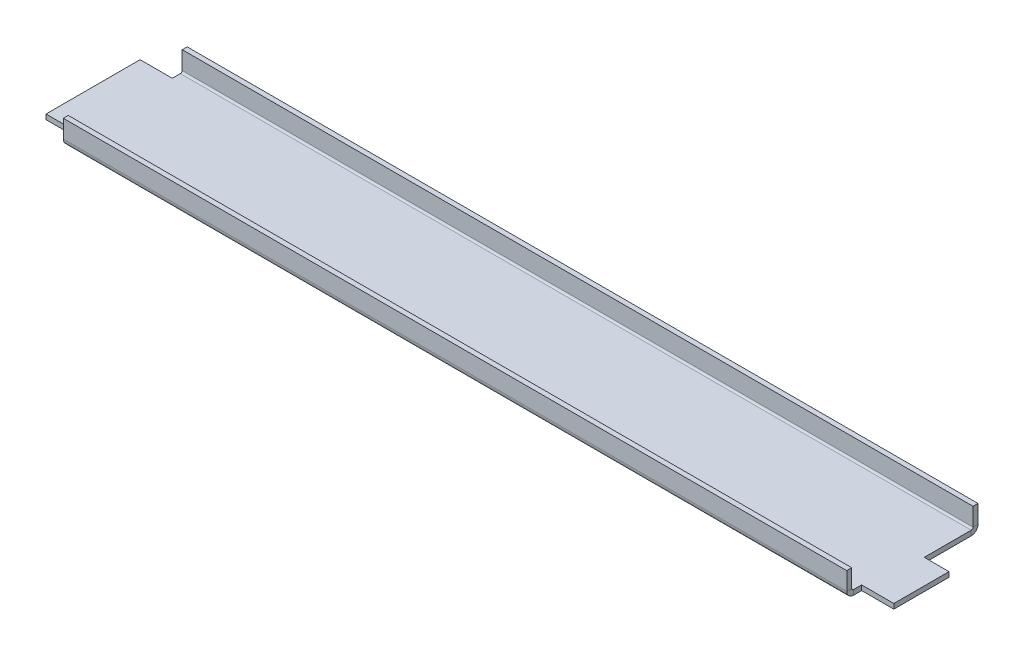
ISO-10303-21;
HEADER;
FILE_DESCRIPTION(('STEP AP214'),'2;1');
FILE_NAME('part.step','',(''),(''),'','','');
FILE_SCHEMA(('AUTOMOTIVE_DESIGN { 1 0 10303 214 1 1 1 1 }'));
ENDSEC;
DATA;
#1=APPLICATION_CONTEXT('core data for automotive mechanical design processes');
#2=APPLICATION_PROTOCOL_DEFINITION('international standard','automotive_design',2000,#1);
#3=PRODUCT_CONTEXT('',#1,'mechanical');
#4=PRODUCT('Part','Part','',(#3));
#5=PRODUCT_RELATED_PRODUCT_CATEGORY('part','',(#4));
#6=PRODUCT_DEFINITION_FORMATION('','',#4);
#7=PRODUCT_DEFINITION_CONTEXT('part definition',#1,'design');
#8=PRODUCT_DEFINITION('design','',#6,#7);
#9=PRODUCT_DEFINITION_SHAPE('','',#8);
#10=(LENGTH_UNIT() NAMED_UNIT(*) SI_UNIT(.MILLI.,.METRE.));
#11=(NAMED_UNIT(*) PLANE_ANGLE_UNIT() SI_UNIT($,.RADIAN.));
#12=(NAMED_UNIT(*) SI_UNIT($,.STERADIAN.) SOLID_ANGLE_UNIT());
#13=UNCERTAINTY_MEASURE_WITH_UNIT(LENGTH_MEASURE(1.E-05),#10,'distance_accuracy_value','');
#14=(GEOMETRIC_REPRESENTATION_CONTEXT(3) GLOBAL_UNCERTAINTY_ASSIGNED_CONTEXT((#13)) GLOBAL_UNIT_ASSIGNED_CONTEXT((#10,
#11,#12)) REPRESENTATION_CONTEXT('',''));
#15=CARTESIAN_POINT('',(0.,0.,0.));
#16=DIRECTION('',(0.,0.,1.));
#17=DIRECTION('',(1.,0.,0.));
#18=AXIS2_PLACEMENT_3D('',#15,#16,#17);
#19=CARTESIAN_POINT('',(158.2,0.,41.5713514705962));
#20=DIRECTION('',(1.,0.,0.));
#21=DIRECTION('',(0.,0.,-1.));
#22=AXIS2_PLACEMENT_3D('',#19,#20,#21);
#23=PLANE('',#22);
#24=DIRECTION('',(0.,-1.,0.));
#25=VECTOR('',#24,1.);
#26=CARTESIAN_POINT('',(158.2,0.,25.));
#27=LINE('',#26,#25);
#28=CARTESIAN_POINT('',(158.2,10.0000000008488,25.));
#29=VERTEX_POINT('',#28);
#30=CARTESIAN_POINT('',(158.2,2.7366,25.));
#31=VERTEX_POINT('',#30);
#32=EDGE_CURVE('E237',#29,#31,#27,.T.);
#33=ORIENTED_EDGE('',*,*,#32,.T.);
#34=DIRECTION('',(0.,0.,-1.));
#35=VECTOR('',#34,1.);
#36=CARTESIAN_POINT('',(158.2,2.7366,25.));
#37=LINE('',#36,#35);
#38=CARTESIAN_POINT('',(158.2,2.7366,23.));
#39=VERTEX_POINT('',#38);
#40=EDGE_CURVE('E14',#31,#39,#37,.T.);
#41=ORIENTED_EDGE('',*,*,#40,.T.);
#42=DIRECTION('',(0.,-1.,0.));
#43=VECTOR('',#42,1.);
#44=CARTESIAN_POINT('',(158.2,0.,23.));
#45=LINE('',#44,#43);
#46=CARTESIAN_POINT('',(158.2,10.,23.));
#47=VERTEX_POINT('',#46);
#48=EDGE_CURVE('E106',#47,#39,#45,.T.);
#49=ORIENTED_EDGE('',*,*,#48,.F.);
#50=DIRECTION('',(0.,0.,1.));
#51=VECTOR('',#50,1.);
#52=CARTESIAN_POINT('',(158.2,10.,25.));
#53=LINE('',#52,#51);
#54=EDGE_CURVE('E132',#47,#29,#53,.T.);
#55=ORIENTED_EDGE('',*,*,#54,.T.);
#56=EDGE_LOOP('',(#33,#41,#49,#55));
#57=FACE_BOUND('',#56,.T.);
#58=ADVANCED_FACE('F87',(#57),#23,.T.);
#59=DIRECTION('',(0.,0.,-1.));
#60=VECTOR('',#59,1.);
#61=CARTESIAN_POINT('',(158.2,2.,0.));
#62=LINE('',#61,#60);
#63=CARTESIAN_POINT('',(158.2,2.,22.2634));
#64=VERTEX_POINT('',#63);
#65=CARTESIAN_POINT('',(158.2,2.,19.));
#66=VERTEX_POINT('',#65);
#67=EDGE_CURVE('E332',#64,#66,#62,.T.);
#68=ORIENTED_EDGE('',*,*,#67,.F.);
#69=DIRECTION('',(0.,-1.,0.));
#70=VECTOR('',#69,1.);
#71=CARTESIAN_POINT('',(158.2,2.,22.2634));
#72=LINE('',#71,#70);
#73=CARTESIAN_POINT('',(158.2,0.,22.2634));
#74=VERTEX_POINT('',#73);
#75=EDGE_CURVE('E98',#64,#74,#72,.T.);
#76=ORIENTED_EDGE('',*,*,#75,.T.);
#77=DIRECTION('',(0.,0.,-1.));
#78=VECTOR('',#77,1.);
#79=CARTESIAN_POINT('',(158.2,0.,41.5713514705962));
#80=LINE('',#79,#78);
#81=CARTESIAN_POINT('',(158.2,0.,19.));
#82=VERTEX_POINT('',#81);
#83=EDGE_CURVE('E498',#74,#82,#80,.T.);
#84=ORIENTED_EDGE('',*,*,#83,.T.);
#85=DIRECTION('',(0.,1.,0.));
#86=VECTOR('',#85,1.);
#87=CARTESIAN_POINT('',(158.2,0.,19.));
#88=LINE('',#87,#86);
#89=EDGE_CURVE('E309',#82,#66,#88,.T.);
#90=ORIENTED_EDGE('',*,*,#89,.T.);
#91=EDGE_LOOP('',(#68,#76,#84,#90));
#92=FACE_BOUND('',#91,.T.);
#93=ADVANCED_FACE('F509',(#92),#23,.T.);
#94=CARTESIAN_POINT('',(161.2,0.,-41.5713514705962));
#95=DIRECTION('',(1.,0.,0.));
#96=DIRECTION('',(0.,0.,-1.));
#97=AXIS2_PLACEMENT_3D('',#94,#95,#96);
#98=PLANE('',#97);
#99=DIRECTION('',(0.,1.,0.));
#100=VECTOR('',#99,1.);
#101=CARTESIAN_POINT('',(161.2,0.,-23.));
#102=LINE('',#101,#100);
#103=CARTESIAN_POINT('',(161.2,2.7366,-23.));
#104=VERTEX_POINT('',#103);
#105=CARTESIAN_POINT('',(161.2,10.,-23.));
#106=VERTEX_POINT('',#105);
#107=EDGE_CURVE('E305',#104,#106,#102,.T.);
#108=ORIENTED_EDGE('',*,*,#107,.F.);
#109=DIRECTION('',(0.,0.,-1.));
#110=VECTOR('',#109,1.);
#111=CARTESIAN_POINT('',(161.2,2.73659999999999,-41.5713514705962));
#112=LINE('',#111,#110);
#113=CARTESIAN_POINT('',(161.2,2.7366,-25.));
#114=VERTEX_POINT('',#113);
#115=EDGE_CURVE('E127',#104,#114,#112,.T.);
#116=ORIENTED_EDGE('',*,*,#115,.T.);
#117=DIRECTION('',(0.,1.,0.));
#118=VECTOR('',#117,1.);
#119=CARTESIAN_POINT('',(161.2,0.,-25.));
#120=LINE('',#119,#118);
#121=CARTESIAN_POINT('',(161.2,10.,-25.));
#122=VERTEX_POINT('',#121);
#123=EDGE_CURVE('E304',#114,#122,#120,.T.);
#124=ORIENTED_EDGE('',*,*,#123,.T.);
#125=DIRECTION('',(0.,0.,1.));
#126=VECTOR('',#125,1.);
#127=CARTESIAN_POINT('',(161.2,10.,-25.));
#128=LINE('',#127,#126);
#129=EDGE_CURVE('E289',#122,#106,#128,.T.);
#130=ORIENTED_EDGE('',*,*,#129,.T.);
#131=EDGE_LOOP('',(#108,#116,#124,#130));
#132=FACE_BOUND('',#131,.T.);
#133=ADVANCED_FACE('F89',(#132),#98,.T.);
#134=CARTESIAN_POINT('',(161.2,0.,0.));
#135=DIRECTION('',(-1.,0.,0.));
#136=DIRECTION('',(0.,0.,1.));
#137=AXIS2_PLACEMENT_3D('',#134,#135,#136);
#138=PLANE('',#137);
#139=DIRECTION('',(0.,0.,1.));
#140=VECTOR('',#139,1.);
#141=CARTESIAN_POINT('',(161.2,0.,0.));
#142=LINE('',#141,#140);
#143=CARTESIAN_POINT('',(161.2,0.,-22.2634));
#144=VERTEX_POINT('',#143);
#145=CARTESIAN_POINT('',(161.2,0.,-3.30000000000009));
#146=VERTEX_POINT('',#145);
#147=EDGE_CURVE('E419',#144,#146,#142,.T.);
#148=ORIENTED_EDGE('',*,*,#147,.F.);
#149=DIRECTION('',(0.,1.,0.));
#150=VECTOR('',#149,1.);
#151=CARTESIAN_POINT('',(161.2,0.,-22.2634));
#152=LINE('',#151,#150);
#153=CARTESIAN_POINT('',(161.2,2.,-22.2634));
#154=VERTEX_POINT('',#153);
#155=EDGE_CURVE('E293',#144,#154,#152,.T.);
#156=ORIENTED_EDGE('',*,*,#155,.T.);
#157=DIRECTION('',(0.,0.,1.));
#158=VECTOR('',#157,1.);
#159=CARTESIAN_POINT('',(161.2,2.,0.));
#160=LINE('',#159,#158);
#161=CARTESIAN_POINT('',(161.2,2.,-3.30000000000009));
#162=VERTEX_POINT('',#161);
#163=EDGE_CURVE('E414',#154,#162,#160,.T.);
#164=ORIENTED_EDGE('',*,*,#163,.T.);
#165=DIRECTION('',(0.,-1.,0.));
#166=VECTOR('',#165,1.);
#167=CARTESIAN_POINT('',(161.2,10.0000000008488,-3.30000000000009));
#168=LINE('',#167,#166);
#169=EDGE_CURVE('E410',#162,#146,#168,.T.);
#170=ORIENTED_EDGE('',*,*,#169,.T.);
#171=EDGE_LOOP('',(#148,#156,#164,#170));
#172=FACE_BOUND('',#171,.T.);
#173=ADVANCED_FACE('F483',(#172),#138,.F.);
#174=CARTESIAN_POINT('',(171.2,2.,-25.));
#175=DIRECTION('',(-1.,0.,0.));
#176=DIRECTION('',(0.,0.,1.));
#177=AXIS2_PLACEMENT_3D('',#174,#175,#176);
#178=PLANE('',#177);
#179=DIRECTION('',(0.,1.,0.));
#180=VECTOR('',#179,1.);
#181=CARTESIAN_POINT('',(171.2,2.,19.));
#182=LINE('',#181,#180);
#183=CARTESIAN_POINT('',(171.2,0.,19.));
#184=VERTEX_POINT('',#183);
#185=CARTESIAN_POINT('',(171.2,2.,19.));
#186=VERTEX_POINT('',#185);
#187=EDGE_CURVE('E349',#184,#186,#182,.T.);
#188=ORIENTED_EDGE('',*,*,#187,.F.);
#189=DIRECTION('',(0.,0.,-1.));
#190=VECTOR('',#189,1.);
#191=CARTESIAN_POINT('',(171.2,0.,-25.));
#192=LINE('',#191,#190);
#193=CARTESIAN_POINT('',(171.2,0.,-3.30000000000009));
#194=VERTEX_POINT('',#193);
#195=EDGE_CURVE('E457',#184,#194,#192,.T.);
#196=ORIENTED_EDGE('',*,*,#195,.T.);
#197=DIRECTION('',(0.,-1.,0.));
#198=VECTOR('',#197,1.);
#199=CARTESIAN_POINT('',(171.2,10.0000000008488,-3.30000000000009));
#200=LINE('',#199,#198);
#201=CARTESIAN_POINT('',(171.2,2.,-3.30000000000009));
#202=VERTEX_POINT('',#201);
#203=EDGE_CURVE('E411',#202,#194,#200,.T.);
#204=ORIENTED_EDGE('',*,*,#203,.F.);
#205=DIRECTION('',(0.,0.,-1.));
#206=VECTOR('',#205,1.);
#207=CARTESIAN_POINT('',(171.2,2.,-25.));
#208=LINE('',#207,#206);
#209=EDGE_CURVE('E460',#186,#202,#208,.T.);
#210=ORIENTED_EDGE('',*,*,#209,.F.);
#211=EDGE_LOOP('',(#188,#196,#204,#210));
#212=FACE_BOUND('',#211,.T.);
#213=ADVANCED_FACE('F492',(#212),#178,.F.);
#214=CARTESIAN_POINT('',(0.,2.,0.));
#215=DIRECTION('',(0.,1.,0.));
#216=DIRECTION('',(0.,0.,1.));
#217=AXIS2_PLACEMENT_3D('',#214,#215,#216);
#218=PLANE('',#217);
#219=ORIENTED_EDGE('',*,*,#163,.F.);
#220=DIRECTION('',(-1.,0.,0.));
#221=VECTOR('',#220,1.);
#222=CARTESIAN_POINT('',(-171.2,1.99999999999999,-22.2634));
#223=LINE('',#222,#221);
#224=CARTESIAN_POINT('',(-158.2,1.99999999999999,-22.2634));
#225=VERTEX_POINT('',#224);
#226=EDGE_CURVE('E431',#225,#154,#223,.F.);
#227=ORIENTED_EDGE('',*,*,#226,.F.);
#228=DIRECTION('',(0.,0.,-1.));
#229=VECTOR('',#228,1.);
#230=CARTESIAN_POINT('',(-158.2,2.,0.));
#231=LINE('',#230,#229);
#232=CARTESIAN_POINT('',(-158.2,2.,-19.));
#233=VERTEX_POINT('',#232);
#234=EDGE_CURVE('E381',#233,#225,#231,.T.);
#235=ORIENTED_EDGE('',*,*,#234,.F.);
#236=DIRECTION('',(1.,0.,0.));
#237=VECTOR('',#236,1.);
#238=CARTESIAN_POINT('',(0.,2.,-19.));
#239=LINE('',#238,#237);
#240=CARTESIAN_POINT('',(-171.2,2.,-19.));
#241=VERTEX_POINT('',#240);
#242=EDGE_CURVE('E407',#241,#233,#239,.T.);
#243=ORIENTED_EDGE('',*,*,#242,.F.);
#244=DIRECTION('',(0.,0.,1.));
#245=VECTOR('',#244,1.);
#246=CARTESIAN_POINT('',(-171.2,2.,-25.));
#247=LINE('',#246,#245);
#248=CARTESIAN_POINT('',(-171.2,2.,19.));
#249=VERTEX_POINT('',#248);
#250=EDGE_CURVE('E463',#241,#249,#247,.T.);
#251=ORIENTED_EDGE('',*,*,#250,.T.);
#252=DIRECTION('',(-1.,0.,0.));
#253=VECTOR('',#252,1.);
#254=CARTESIAN_POINT('',(0.,2.,19.));
#255=LINE('',#254,#253);
#256=CARTESIAN_POINT('',(-158.2,2.,19.));
#257=VERTEX_POINT('',#256);
#258=EDGE_CURVE('E404',#257,#249,#255,.T.);
#259=ORIENTED_EDGE('',*,*,#258,.F.);
#260=DIRECTION('',(0.,0.,-1.));
#261=VECTOR('',#260,1.);
#262=CARTESIAN_POINT('',(-158.2,2.,0.));
#263=LINE('',#262,#261);
#264=CARTESIAN_POINT('',(-158.2,2.,22.2634));
#265=VERTEX_POINT('',#264);
#266=EDGE_CURVE('E255',#265,#257,#263,.T.);
#267=ORIENTED_EDGE('',*,*,#266,.F.);
#268=DIRECTION('',(1.,0.,0.));
#269=VECTOR('',#268,1.);
#270=CARTESIAN_POINT('',(171.2,2.,22.2634));
#271=LINE('',#270,#269);
#272=EDGE_CURVE('E241',#64,#265,#271,.F.);
#273=ORIENTED_EDGE('',*,*,#272,.F.);
#274=ORIENTED_EDGE('',*,*,#67,.T.);
#275=DIRECTION('',(1.,0.,0.));
#276=VECTOR('',#275,1.);
#277=CARTESIAN_POINT('',(0.,2.,19.));
#278=LINE('',#277,#276);
#279=EDGE_CURVE('E346',#66,#186,#278,.T.);
#280=ORIENTED_EDGE('',*,*,#279,.T.);
#281=ORIENTED_EDGE('',*,*,#209,.T.);
#282=DIRECTION('',(-1.,0.,0.));
#283=VECTOR('',#282,1.);
#284=CARTESIAN_POINT('',(0.,2.,-3.30000000000009));
#285=LINE('',#284,#283);
#286=EDGE_CURVE('E422',#202,#162,#285,.T.);
#287=ORIENTED_EDGE('',*,*,#286,.T.);
#288=EDGE_LOOP('',(#219,#227,#235,#243,#251,#259,#267,#273,#274,#280,#281,#287));
#289=FACE_BOUND('',#288,.T.);
#290=ADVANCED_FACE('F487',(#289),#218,.T.);
#291=CARTESIAN_POINT('',(0.,0.,0.));
#292=DIRECTION('',(0.,1.,0.));
#293=DIRECTION('',(0.,0.,1.));
#294=AXIS2_PLACEMENT_3D('',#291,#292,#293);
#295=PLANE('',#294);
#296=DIRECTION('',(-1.,0.,0.));
#297=VECTOR('',#296,1.);
#298=CARTESIAN_POINT('',(-171.2,0.,-22.2634));
#299=LINE('',#298,#297);
#300=CARTESIAN_POINT('',(-158.2,0.,-22.2634));
#301=VERTEX_POINT('',#300);
#302=EDGE_CURVE('E440',#301,#144,#299,.F.);
#303=ORIENTED_EDGE('',*,*,#302,.T.);
#304=ORIENTED_EDGE('',*,*,#147,.T.);
#305=DIRECTION('',(-1.,0.,0.));
#306=VECTOR('',#305,1.);
#307=CARTESIAN_POINT('',(0.,0.,-3.30000000000009));
#308=LINE('',#307,#306);
#309=EDGE_CURVE('E270',#194,#146,#308,.T.);
#310=ORIENTED_EDGE('',*,*,#309,.F.);
#311=ORIENTED_EDGE('',*,*,#195,.F.);
#312=DIRECTION('',(1.,0.,0.));
#313=VECTOR('',#312,1.);
#314=CARTESIAN_POINT('',(211.638156900471,0.,19.));
#315=LINE('',#314,#313);
#316=EDGE_CURVE('E496',#82,#184,#315,.T.);
#317=ORIENTED_EDGE('',*,*,#316,.F.);
#318=ORIENTED_EDGE('',*,*,#83,.F.);
#319=DIRECTION('',(1.,0.,0.));
#320=VECTOR('',#319,1.);
#321=CARTESIAN_POINT('',(171.2,0.,22.2634));
#322=LINE('',#321,#320);
#323=CARTESIAN_POINT('',(-158.2,0.,22.2634));
#324=VERTEX_POINT('',#323);
#325=EDGE_CURVE('E454',#74,#324,#322,.F.);
#326=ORIENTED_EDGE('',*,*,#325,.T.);
#327=DIRECTION('',(0.,0.,-1.));
#328=VECTOR('',#327,1.);
#329=CARTESIAN_POINT('',(-158.2,0.,41.5713514705962));
#330=LINE('',#329,#328);
#331=CARTESIAN_POINT('',(-158.2,0.,19.));
#332=VERTEX_POINT('',#331);
#333=EDGE_CURVE('E352',#324,#332,#330,.T.);
#334=ORIENTED_EDGE('',*,*,#333,.T.);
#335=DIRECTION('',(-1.,0.,0.));
#336=VECTOR('',#335,1.);
#337=CARTESIAN_POINT('',(-211.638156900471,0.,19.));
#338=LINE('',#337,#336);
#339=CARTESIAN_POINT('',(-171.2,0.,19.));
#340=VERTEX_POINT('',#339);
#341=EDGE_CURVE('E368',#332,#340,#338,.T.);
#342=ORIENTED_EDGE('',*,*,#341,.T.);
#343=DIRECTION('',(0.,0.,1.));
#344=VECTOR('',#343,1.);
#345=CARTESIAN_POINT('',(-171.2,0.,-25.));
#346=LINE('',#345,#344);
#347=CARTESIAN_POINT('',(-171.2,0.,-19.));
#348=VERTEX_POINT('',#347);
#349=EDGE_CURVE('E464',#348,#340,#346,.T.);
#350=ORIENTED_EDGE('',*,*,#349,.F.);
#351=DIRECTION('',(1.,0.,0.));
#352=VECTOR('',#351,1.);
#353=CARTESIAN_POINT('',(-211.638156900471,0.,-19.));
#354=LINE('',#353,#352);
#355=CARTESIAN_POINT('',(-158.2,0.,-19.));
#356=VERTEX_POINT('',#355);
#357=EDGE_CURVE('E353',#348,#356,#354,.T.);
#358=ORIENTED_EDGE('',*,*,#357,.T.);
#359=DIRECTION('',(0.,0.,-1.));
#360=VECTOR('',#359,1.);
#361=CARTESIAN_POINT('',(-158.2,0.,-41.5713514705962));
#362=LINE('',#361,#360);
#363=EDGE_CURVE('E357',#356,#301,#362,.T.);
#364=ORIENTED_EDGE('',*,*,#363,.T.);
#365=EDGE_LOOP('',(#303,#304,#310,#311,#317,#318,#326,#334,#342,#350,#358,#364));
#366=FACE_BOUND('',#365,.T.);
#367=ADVANCED_FACE('F494',(#366),#295,.F.);
#368=CARTESIAN_POINT('',(171.2,2.7366,22.2634));
#369=DIRECTION('',(1.,0.,0.));
#370=DIRECTION('',(0.,0.,1.));
#371=AXIS2_PLACEMENT_3D('',#368,#369,#370);
#372=CYLINDRICAL_SURFACE('',#371,2.7366);
#373=ORIENTED_EDGE('',*,*,#325,.F.);
#374=CARTESIAN_POINT('',(158.2,2.7366,22.2634));
#375=DIRECTION('',(1.,0.,0.));
#376=DIRECTION('',(0.,0.,-1.));
#377=AXIS2_PLACEMENT_3D('',#374,#375,#376);
#378=CIRCLE('',#377,2.7366);
#379=EDGE_CURVE('E342',#74,#31,#378,.F.);
#380=ORIENTED_EDGE('',*,*,#379,.T.);
#381=DIRECTION('',(1.,0.,0.));
#382=VECTOR('',#381,1.);
#383=CARTESIAN_POINT('',(-171.2,2.7366,25.));
#384=LINE('',#383,#382);
#385=CARTESIAN_POINT('',(-158.2,2.7366,25.));
#386=VERTEX_POINT('',#385);
#387=EDGE_CURVE('E449',#31,#386,#384,.F.);
#388=ORIENTED_EDGE('',*,*,#387,.T.);
#389=CARTESIAN_POINT('',(-158.2,2.7366,22.2634));
#390=DIRECTION('',(1.,0.,0.));
#391=DIRECTION('',(0.,0.,-1.));
#392=AXIS2_PLACEMENT_3D('',#389,#390,#391);
#393=CIRCLE('',#392,2.7366);
#394=EDGE_CURVE('E254',#324,#386,#393,.F.);
#395=ORIENTED_EDGE('',*,*,#394,.F.);
#396=EDGE_LOOP('',(#373,#380,#388,#395));
#397=FACE_BOUND('',#396,.T.);
#398=ADVANCED_FACE('F550',(#397),#372,.T.);
#399=CARTESIAN_POINT('',(171.2,2.7366,22.2634));
#400=DIRECTION('',(1.,0.,0.));
#401=DIRECTION('',(0.,0.,1.));
#402=AXIS2_PLACEMENT_3D('',#399,#400,#401);
#403=CYLINDRICAL_SURFACE('',#402,0.7366);
#404=CARTESIAN_POINT('',(158.2,2.7366,22.2634));
#405=DIRECTION('',(1.,0.,0.));
#406=DIRECTION('',(0.,0.,-1.));
#407=AXIS2_PLACEMENT_3D('',#404,#405,#406);
#408=CIRCLE('',#407,0.7366);
#409=EDGE_CURVE('E323',#64,#39,#408,.F.);
#410=ORIENTED_EDGE('',*,*,#409,.F.);
#411=ORIENTED_EDGE('',*,*,#272,.T.);
#412=CARTESIAN_POINT('',(-158.2,2.7366,22.2634));
#413=DIRECTION('',(1.,0.,0.));
#414=DIRECTION('',(0.,0.,-1.));
#415=AXIS2_PLACEMENT_3D('',#412,#413,#414);
#416=CIRCLE('',#415,0.7366);
#417=CARTESIAN_POINT('',(-158.2,2.7366,23.));
#418=VERTEX_POINT('',#417);
#419=EDGE_CURVE('E396',#265,#418,#416,.F.);
#420=ORIENTED_EDGE('',*,*,#419,.T.);
#421=DIRECTION('',(1.,0.,0.));
#422=VECTOR('',#421,1.);
#423=CARTESIAN_POINT('',(-171.2,2.7366,23.));
#424=LINE('',#423,#422);
#425=EDGE_CURVE('E443',#418,#39,#424,.T.);
#426=ORIENTED_EDGE('',*,*,#425,.T.);
#427=EDGE_LOOP('',(#410,#411,#420,#426));
#428=FACE_BOUND('',#427,.T.);
#429=ADVANCED_FACE('F515',(#428),#403,.F.);
#430=CARTESIAN_POINT('',(0.,0.,25.));
#431=DIRECTION('',(0.,0.,-1.));
#432=DIRECTION('',(-1.,0.,0.));
#433=AXIS2_PLACEMENT_3D('',#430,#431,#432);
#434=PLANE('',#433);
#435=ORIENTED_EDGE('',*,*,#32,.F.);
#436=DIRECTION('',(-1.,0.,0.));
#437=VECTOR('',#436,1.);
#438=CARTESIAN_POINT('',(0.,10.,25.));
#439=LINE('',#438,#437);
#440=CARTESIAN_POINT('',(-158.2,10.,25.));
#441=VERTEX_POINT('',#440);
#442=EDGE_CURVE('E232',#29,#441,#439,.T.);
#443=ORIENTED_EDGE('',*,*,#442,.T.);
#444=DIRECTION('',(0.,-1.,0.));
#445=VECTOR('',#444,1.);
#446=CARTESIAN_POINT('',(-158.2,0.,25.));
#447=LINE('',#446,#445);
#448=EDGE_CURVE('E236',#441,#386,#447,.T.);
#449=ORIENTED_EDGE('',*,*,#448,.T.);
#450=ORIENTED_EDGE('',*,*,#387,.F.);
#451=EDGE_LOOP('',(#435,#443,#449,#450));
#452=FACE_BOUND('',#451,.T.);
#453=ADVANCED_FACE('F234',(#452),#434,.F.);
#454=CARTESIAN_POINT('',(0.,0.,23.));
#455=DIRECTION('',(0.,0.,-1.));
#456=DIRECTION('',(-1.,0.,0.));
#457=AXIS2_PLACEMENT_3D('',#454,#455,#456);
#458=PLANE('',#457);
#459=DIRECTION('',(1.,0.,0.));
#460=VECTOR('',#459,1.);
#461=CARTESIAN_POINT('',(-171.2,10.,23.));
#462=LINE('',#461,#460);
#463=CARTESIAN_POINT('',(-158.2,10.0000000008488,23.));
#464=VERTEX_POINT('',#463);
#465=EDGE_CURVE('E242',#47,#464,#462,.F.);
#466=ORIENTED_EDGE('',*,*,#465,.F.);
#467=ORIENTED_EDGE('',*,*,#48,.T.);
#468=ORIENTED_EDGE('',*,*,#425,.F.);
#469=DIRECTION('',(0.,-1.,0.));
#470=VECTOR('',#469,1.);
#471=CARTESIAN_POINT('',(-158.2,0.,23.));
#472=LINE('',#471,#470);
#473=EDGE_CURVE('E393',#464,#418,#472,.T.);
#474=ORIENTED_EDGE('',*,*,#473,.F.);
#475=EDGE_LOOP('',(#466,#467,#468,#474));
#476=FACE_BOUND('',#475,.T.);
#477=ADVANCED_FACE('F524',(#476),#458,.T.);
#478=CARTESIAN_POINT('',(-171.2,10.,25.));
#479=DIRECTION('',(0.,-1.,0.));
#480=DIRECTION('',(0.,0.,-1.));
#481=AXIS2_PLACEMENT_3D('',#478,#479,#480);
#482=PLANE('',#481);
#483=ORIENTED_EDGE('',*,*,#54,.F.);
#484=ORIENTED_EDGE('',*,*,#465,.T.);
#485=DIRECTION('',(0.,0.,1.));
#486=VECTOR('',#485,1.);
#487=CARTESIAN_POINT('',(-158.2,10.,25.));
#488=LINE('',#487,#486);
#489=EDGE_CURVE('E249',#464,#441,#488,.T.);
#490=ORIENTED_EDGE('',*,*,#489,.T.);
#491=ORIENTED_EDGE('',*,*,#442,.F.);
#492=EDGE_LOOP('',(#483,#484,#490,#491));
#493=FACE_BOUND('',#492,.T.);
#494=ADVANCED_FACE('F257',(#493),#482,.F.);
#495=CARTESIAN_POINT('',(-171.2,2.7366,-22.2634));
#496=DIRECTION('',(-1.,0.,0.));
#497=DIRECTION('',(0.,0.,-1.));
#498=AXIS2_PLACEMENT_3D('',#495,#496,#497);
#499=CYLINDRICAL_SURFACE('',#498,2.7366);
#500=DIRECTION('',(-1.,0.,0.));
#501=VECTOR('',#500,1.);
#502=CARTESIAN_POINT('',(171.2,2.73660000000001,-25.));
#503=LINE('',#502,#501);
#504=CARTESIAN_POINT('',(-158.2,2.73660000000001,-25.));
#505=VERTEX_POINT('',#504);
#506=EDGE_CURVE('E436',#505,#114,#503,.F.);
#507=ORIENTED_EDGE('',*,*,#506,.T.);
#508=CARTESIAN_POINT('',(161.2,2.7366,-22.2634));
#509=DIRECTION('',(1.,0.,0.));
#510=DIRECTION('',(0.,0.,-1.));
#511=AXIS2_PLACEMENT_3D('',#508,#509,#510);
#512=CIRCLE('',#511,2.7366);
#513=EDGE_CURVE('E91',#114,#144,#512,.F.);
#514=ORIENTED_EDGE('',*,*,#513,.T.);
#515=ORIENTED_EDGE('',*,*,#302,.F.);
#516=CARTESIAN_POINT('',(-158.2,2.7366,-22.2634));
#517=DIRECTION('',(1.,0.,0.));
#518=DIRECTION('',(0.,0.,-1.));
#519=AXIS2_PLACEMENT_3D('',#516,#517,#518);
#520=CIRCLE('',#519,2.7366);
#521=EDGE_CURVE('E389',#505,#301,#520,.F.);
#522=ORIENTED_EDGE('',*,*,#521,.F.);
#523=EDGE_LOOP('',(#507,#514,#515,#522));
#524=FACE_BOUND('',#523,.T.);
#525=ADVANCED_FACE('F531',(#524),#499,.T.);
#526=CARTESIAN_POINT('',(-171.2,2.7366,-22.2634));
#527=DIRECTION('',(-1.,0.,0.));
#528=DIRECTION('',(0.,0.,-1.));
#529=AXIS2_PLACEMENT_3D('',#526,#527,#528);
#530=CYLINDRICAL_SURFACE('',#529,0.7366);
#531=CARTESIAN_POINT('',(161.2,2.7366,-22.2634));
#532=DIRECTION('',(1.,0.,0.));
#533=DIRECTION('',(0.,0.,-1.));
#534=AXIS2_PLACEMENT_3D('',#531,#532,#533);
#535=CIRCLE('',#534,0.7366);
#536=EDGE_CURVE('E300',#104,#154,#535,.F.);
#537=ORIENTED_EDGE('',*,*,#536,.F.);
#538=DIRECTION('',(-1.,0.,0.));
#539=VECTOR('',#538,1.);
#540=CARTESIAN_POINT('',(171.2,2.7366,-23.));
#541=LINE('',#540,#539);
#542=CARTESIAN_POINT('',(-158.2,2.73659999999999,-23.));
#543=VERTEX_POINT('',#542);
#544=EDGE_CURVE('E426',#104,#543,#541,.T.);
#545=ORIENTED_EDGE('',*,*,#544,.T.);
#546=CARTESIAN_POINT('',(-158.2,2.7366,-22.2634));
#547=DIRECTION('',(1.,0.,0.));
#548=DIRECTION('',(0.,0.,-1.));
#549=AXIS2_PLACEMENT_3D('',#546,#547,#548);
#550=CIRCLE('',#549,0.7366);
#551=EDGE_CURVE('E377',#543,#225,#550,.F.);
#552=ORIENTED_EDGE('',*,*,#551,.T.);
#553=ORIENTED_EDGE('',*,*,#226,.T.);
#554=EDGE_LOOP('',(#537,#545,#552,#553));
#555=FACE_BOUND('',#554,.T.);
#556=ADVANCED_FACE('F566',(#555),#530,.F.);
#557=CARTESIAN_POINT('',(0.,0.,-25.));
#558=DIRECTION('',(0.,0.,1.));
#559=DIRECTION('',(0.,-1.,0.));
#560=AXIS2_PLACEMENT_3D('',#557,#558,#559);
#561=PLANE('',#560);
#562=ORIENTED_EDGE('',*,*,#123,.F.);
#563=ORIENTED_EDGE('',*,*,#506,.F.);
#564=DIRECTION('',(0.,1.,0.));
#565=VECTOR('',#564,1.);
#566=CARTESIAN_POINT('',(-158.2,0.,-25.));
#567=LINE('',#566,#565);
#568=CARTESIAN_POINT('',(-158.2,10.0000000008488,-25.));
#569=VERTEX_POINT('',#568);
#570=EDGE_CURVE('E385',#505,#569,#567,.T.);
#571=ORIENTED_EDGE('',*,*,#570,.T.);
#572=DIRECTION('',(1.,0.,0.));
#573=VECTOR('',#572,1.);
#574=CARTESIAN_POINT('',(0.,10.,-25.));
#575=LINE('',#574,#573);
#576=EDGE_CURVE('E427',#569,#122,#575,.T.);
#577=ORIENTED_EDGE('',*,*,#576,.T.);
#578=EDGE_LOOP('',(#562,#563,#571,#577));
#579=FACE_BOUND('',#578,.T.);
#580=ADVANCED_FACE('F581',(#579),#561,.F.);
#581=CARTESIAN_POINT('',(0.,0.,-23.));
#582=DIRECTION('',(0.,0.,1.));
#583=DIRECTION('',(0.,-1.,0.));
#584=AXIS2_PLACEMENT_3D('',#581,#582,#583);
#585=PLANE('',#584);
#586=ORIENTED_EDGE('',*,*,#544,.F.);
#587=ORIENTED_EDGE('',*,*,#107,.T.);
#588=DIRECTION('',(-1.,0.,0.));
#589=VECTOR('',#588,1.);
#590=CARTESIAN_POINT('',(171.2,10.,-23.));
#591=LINE('',#590,#589);
#592=CARTESIAN_POINT('',(-158.2,10.,-23.));
#593=VERTEX_POINT('',#592);
#594=EDGE_CURVE('E432',#593,#106,#591,.F.);
#595=ORIENTED_EDGE('',*,*,#594,.F.);
#596=DIRECTION('',(0.,1.,0.));
#597=VECTOR('',#596,1.);
#598=CARTESIAN_POINT('',(-158.2,0.,-23.));
#599=LINE('',#598,#597);
#600=EDGE_CURVE('E226',#543,#593,#599,.T.);
#601=ORIENTED_EDGE('',*,*,#600,.F.);
#602=EDGE_LOOP('',(#586,#587,#595,#601));
#603=FACE_BOUND('',#602,.T.);
#604=ADVANCED_FACE('F573',(#603),#585,.T.);
#605=CARTESIAN_POINT('',(171.2,10.,-25.));
#606=DIRECTION('',(0.,-1.,0.));
#607=DIRECTION('',(0.,0.,-1.));
#608=AXIS2_PLACEMENT_3D('',#605,#606,#607);
#609=PLANE('',#608);
#610=ORIENTED_EDGE('',*,*,#129,.F.);
#611=ORIENTED_EDGE('',*,*,#576,.F.);
#612=DIRECTION('',(0.,0.,1.));
#613=VECTOR('',#612,1.);
#614=CARTESIAN_POINT('',(-158.2,10.,-25.));
#615=LINE('',#614,#613);
#616=EDGE_CURVE('E261',#569,#593,#615,.T.);
#617=ORIENTED_EDGE('',*,*,#616,.T.);
#618=ORIENTED_EDGE('',*,*,#594,.T.);
#619=EDGE_LOOP('',(#610,#611,#617,#618));
#620=FACE_BOUND('',#619,.T.);
#621=ADVANCED_FACE('F575',(#620),#609,.F.);
#622=CARTESIAN_POINT('',(-158.2,0.,41.5713514705962));
#623=DIRECTION('',(1.,0.,0.));
#624=DIRECTION('',(0.,0.,-1.));
#625=AXIS2_PLACEMENT_3D('',#622,#623,#624);
#626=PLANE('',#625);
#627=ORIENTED_EDGE('',*,*,#473,.T.);
#628=DIRECTION('',(0.,0.,1.));
#629=VECTOR('',#628,1.);
#630=CARTESIAN_POINT('',(-158.2,2.7366,23.));
#631=LINE('',#630,#629);
#632=EDGE_CURVE('E251',#418,#386,#631,.T.);
#633=ORIENTED_EDGE('',*,*,#632,.T.);
#634=ORIENTED_EDGE('',*,*,#448,.F.);
#635=ORIENTED_EDGE('',*,*,#489,.F.);
#636=EDGE_LOOP('',(#627,#633,#634,#635));
#637=FACE_BOUND('',#636,.T.);
#638=ADVANCED_FACE('F248',(#637),#626,.F.);
#639=ORIENTED_EDGE('',*,*,#333,.F.);
#640=DIRECTION('',(0.,1.,0.));
#641=VECTOR('',#640,1.);
#642=CARTESIAN_POINT('',(-158.2,0.,22.2634));
#643=LINE('',#642,#641);
#644=EDGE_CURVE('E283',#324,#265,#643,.T.);
#645=ORIENTED_EDGE('',*,*,#644,.T.);
#646=ORIENTED_EDGE('',*,*,#266,.T.);
#647=DIRECTION('',(0.,1.,0.));
#648=VECTOR('',#647,1.);
#649=CARTESIAN_POINT('',(-158.2,0.,19.));
#650=LINE('',#649,#648);
#651=EDGE_CURVE('E358',#332,#257,#650,.T.);
#652=ORIENTED_EDGE('',*,*,#651,.F.);
#653=EDGE_LOOP('',(#639,#645,#646,#652));
#654=FACE_BOUND('',#653,.T.);
#655=ADVANCED_FACE('F520',(#654),#626,.F.);
#656=CARTESIAN_POINT('',(-158.2,0.,-41.5713514705962));
#657=DIRECTION('',(1.,0.,0.));
#658=DIRECTION('',(0.,0.,-1.));
#659=AXIS2_PLACEMENT_3D('',#656,#657,#658);
#660=PLANE('',#659);
#661=ORIENTED_EDGE('',*,*,#234,.T.);
#662=DIRECTION('',(0.,-1.,0.));
#663=VECTOR('',#662,1.);
#664=CARTESIAN_POINT('',(-158.2,1.99999999999999,-22.2634));
#665=LINE('',#664,#663);
#666=EDGE_CURVE('E280',#225,#301,#665,.T.);
#667=ORIENTED_EDGE('',*,*,#666,.T.);
#668=ORIENTED_EDGE('',*,*,#363,.F.);
#669=DIRECTION('',(0.,1.,0.));
#670=VECTOR('',#669,1.);
#671=CARTESIAN_POINT('',(-158.2,0.,-19.));
#672=LINE('',#671,#670);
#673=EDGE_CURVE('E362',#356,#233,#672,.T.);
#674=ORIENTED_EDGE('',*,*,#673,.T.);
#675=EDGE_LOOP('',(#661,#667,#668,#674));
#676=FACE_BOUND('',#675,.T.);
#677=ADVANCED_FACE('F561',(#676),#660,.F.);
#678=ORIENTED_EDGE('',*,*,#570,.F.);
#679=DIRECTION('',(0.,0.,1.));
#680=VECTOR('',#679,1.);
#681=CARTESIAN_POINT('',(-158.2,2.73660000000001,-25.));
#682=LINE('',#681,#680);
#683=EDGE_CURVE('E277',#505,#543,#682,.T.);
#684=ORIENTED_EDGE('',*,*,#683,.T.);
#685=ORIENTED_EDGE('',*,*,#600,.T.);
#686=ORIENTED_EDGE('',*,*,#616,.F.);
#687=EDGE_LOOP('',(#678,#684,#685,#686));
#688=FACE_BOUND('',#687,.T.);
#689=ADVANCED_FACE('F577',(#688),#660,.F.);
#690=CARTESIAN_POINT('',(-171.2,2.,-25.));
#691=DIRECTION('',(1.,0.,0.));
#692=DIRECTION('',(0.,0.,-1.));
#693=AXIS2_PLACEMENT_3D('',#690,#691,#692);
#694=PLANE('',#693);
#695=ORIENTED_EDGE('',*,*,#250,.F.);
#696=DIRECTION('',(0.,-1.,0.));
#697=VECTOR('',#696,1.);
#698=CARTESIAN_POINT('',(-171.2,2.,-19.));
#699=LINE('',#698,#697);
#700=EDGE_CURVE('E267',#241,#348,#699,.T.);
#701=ORIENTED_EDGE('',*,*,#700,.T.);
#702=ORIENTED_EDGE('',*,*,#349,.T.);
#703=DIRECTION('',(0.,1.,0.));
#704=VECTOR('',#703,1.);
#705=CARTESIAN_POINT('',(-171.2,2.,19.));
#706=LINE('',#705,#704);
#707=EDGE_CURVE('E260',#340,#249,#706,.T.);
#708=ORIENTED_EDGE('',*,*,#707,.T.);
#709=EDGE_LOOP('',(#695,#701,#702,#708));
#710=FACE_BOUND('',#709,.T.);
#711=ADVANCED_FACE('F556',(#710),#694,.F.);
#712=CARTESIAN_POINT('',(171.2,10.0000000008488,-3.30000000000009));
#713=DIRECTION('',(0.,0.,-1.));
#714=DIRECTION('',(-1.,0.,0.));
#715=AXIS2_PLACEMENT_3D('',#712,#713,#714);
#716=PLANE('',#715);
#717=ORIENTED_EDGE('',*,*,#203,.T.);
#718=ORIENTED_EDGE('',*,*,#309,.T.);
#719=ORIENTED_EDGE('',*,*,#169,.F.);
#720=ORIENTED_EDGE('',*,*,#286,.F.);
#721=EDGE_LOOP('',(#717,#718,#719,#720));
#722=FACE_BOUND('',#721,.T.);
#723=ADVANCED_FACE('F476',(#722),#716,.T.);
#724=ORIENTED_EDGE('',*,*,#666,.F.);
#725=ORIENTED_EDGE('',*,*,#551,.F.);
#726=ORIENTED_EDGE('',*,*,#683,.F.);
#727=ORIENTED_EDGE('',*,*,#521,.T.);
#728=EDGE_LOOP('',(#724,#725,#726,#727));
#729=FACE_BOUND('',#728,.T.);
#730=ADVANCED_FACE('F569',(#729),#660,.F.);
#731=CARTESIAN_POINT('',(-211.638156900471,0.,-19.));
#732=DIRECTION('',(0.,0.,1.));
#733=DIRECTION('',(1.,0.,0.));
#734=AXIS2_PLACEMENT_3D('',#731,#732,#733);
#735=PLANE('',#734);
#736=ORIENTED_EDGE('',*,*,#242,.T.);
#737=ORIENTED_EDGE('',*,*,#673,.F.);
#738=ORIENTED_EDGE('',*,*,#357,.F.);
#739=ORIENTED_EDGE('',*,*,#700,.F.);
#740=EDGE_LOOP('',(#736,#737,#738,#739));
#741=FACE_BOUND('',#740,.T.);
#742=ADVANCED_FACE('F559',(#741),#735,.F.);
#743=CARTESIAN_POINT('',(-211.638156900471,0.,19.));
#744=DIRECTION('',(0.,0.,-1.));
#745=DIRECTION('',(-1.,0.,0.));
#746=AXIS2_PLACEMENT_3D('',#743,#744,#745);
#747=PLANE('',#746);
#748=ORIENTED_EDGE('',*,*,#258,.T.);
#749=ORIENTED_EDGE('',*,*,#707,.F.);
#750=ORIENTED_EDGE('',*,*,#341,.F.);
#751=ORIENTED_EDGE('',*,*,#651,.T.);
#752=EDGE_LOOP('',(#748,#749,#750,#751));
#753=FACE_BOUND('',#752,.T.);
#754=ADVANCED_FACE('F601',(#753),#747,.F.);
#755=ORIENTED_EDGE('',*,*,#632,.F.);
#756=ORIENTED_EDGE('',*,*,#419,.F.);
#757=ORIENTED_EDGE('',*,*,#644,.F.);
#758=ORIENTED_EDGE('',*,*,#394,.T.);
#759=EDGE_LOOP('',(#755,#756,#757,#758));
#760=FACE_BOUND('',#759,.T.);
#761=ADVANCED_FACE('F523',(#760),#626,.F.);
#762=ORIENTED_EDGE('',*,*,#155,.F.);
#763=ORIENTED_EDGE('',*,*,#513,.F.);
#764=ORIENTED_EDGE('',*,*,#115,.F.);
#765=ORIENTED_EDGE('',*,*,#536,.T.);
#766=EDGE_LOOP('',(#762,#763,#764,#765));
#767=FACE_BOUND('',#766,.T.);
#768=ADVANCED_FACE('F547',(#767),#98,.T.);
#769=CARTESIAN_POINT('',(211.638156900471,0.,19.));
#770=DIRECTION('',(0.,0.,1.));
#771=DIRECTION('',(1.,0.,0.));
#772=AXIS2_PLACEMENT_3D('',#769,#770,#771);
#773=PLANE('',#772);
#774=ORIENTED_EDGE('',*,*,#187,.T.);
#775=ORIENTED_EDGE('',*,*,#279,.F.);
#776=ORIENTED_EDGE('',*,*,#89,.F.);
#777=ORIENTED_EDGE('',*,*,#316,.T.);
#778=EDGE_LOOP('',(#774,#775,#776,#777));
#779=FACE_BOUND('',#778,.T.);
#780=ADVANCED_FACE('F542',(#779),#773,.T.);
#781=ORIENTED_EDGE('',*,*,#40,.F.);
#782=ORIENTED_EDGE('',*,*,#379,.F.);
#783=ORIENTED_EDGE('',*,*,#75,.F.);
#784=ORIENTED_EDGE('',*,*,#409,.T.);
#785=EDGE_LOOP('',(#781,#782,#783,#784));
#786=FACE_BOUND('',#785,.T.);
#787=ADVANCED_FACE('F536',(#786),#23,.T.);
#788=CLOSED_SHELL('',(#58,#93,#133,#173,#213,#290,#367,#398,#429,#453,#477,#494,#525,#556,#580,
#604,#621,#638,#655,#677,#689,#711,#723,#730,#742,#754,#761,#768,#780,#787));
#789=MANIFOLD_SOLID_BREP('B2',#788);
#790=ADVANCED_BREP_SHAPE_REPRESENTATION('',(#18,#789),#14);
#791=SHAPE_DEFINITION_REPRESENTATION(#9,#790);
ENDSEC;
END-ISO-10303-21;
